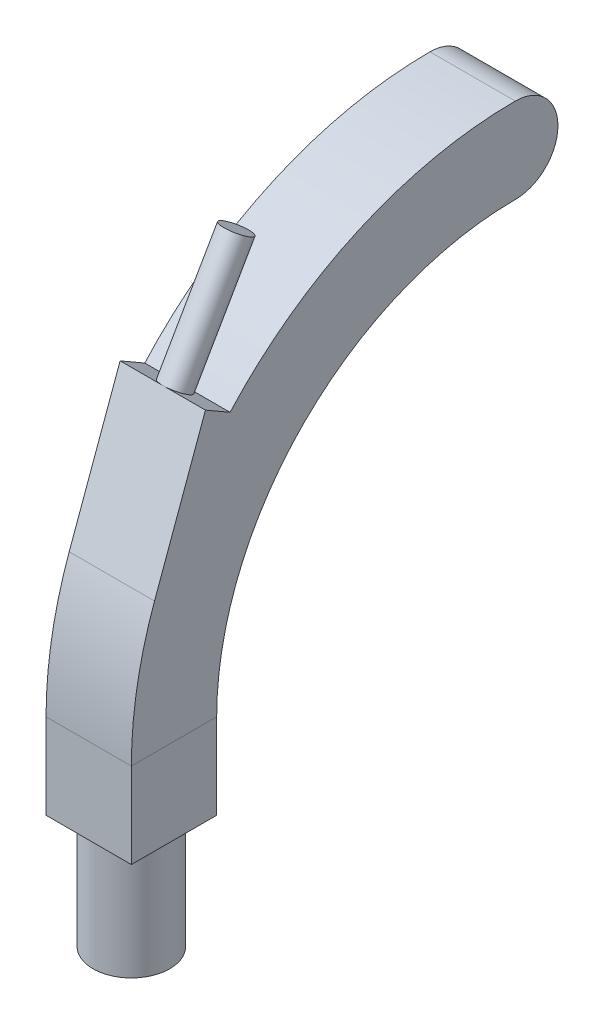
ISO-10303-21;
HEADER;
FILE_DESCRIPTION(('STEP AP214'),'2;1');
FILE_NAME('part.step','',(''),(''),'','','');
FILE_SCHEMA(('AUTOMOTIVE_DESIGN { 1 0 10303 214 1 1 1 1 }'));
ENDSEC;
DATA;
#1=APPLICATION_CONTEXT('core data for automotive mechanical design processes');
#2=APPLICATION_PROTOCOL_DEFINITION('international standard','automotive_design',2000,#1);
#3=PRODUCT_CONTEXT('',#1,'mechanical');
#4=PRODUCT('Part','Part','',(#3));
#5=PRODUCT_RELATED_PRODUCT_CATEGORY('part','',(#4));
#6=PRODUCT_DEFINITION_FORMATION('','',#4);
#7=PRODUCT_DEFINITION_CONTEXT('part definition',#1,'design');
#8=PRODUCT_DEFINITION('design','',#6,#7);
#9=PRODUCT_DEFINITION_SHAPE('','',#8);
#10=(LENGTH_UNIT() NAMED_UNIT(*) SI_UNIT(.MILLI.,.METRE.));
#11=(NAMED_UNIT(*) PLANE_ANGLE_UNIT() SI_UNIT($,.RADIAN.));
#12=(NAMED_UNIT(*) SI_UNIT($,.STERADIAN.) SOLID_ANGLE_UNIT());
#13=UNCERTAINTY_MEASURE_WITH_UNIT(LENGTH_MEASURE(1.E-05),#10,'distance_accuracy_value','');
#14=(GEOMETRIC_REPRESENTATION_CONTEXT(3) GLOBAL_UNCERTAINTY_ASSIGNED_CONTEXT((#13)) GLOBAL_UNIT_ASSIGNED_CONTEXT((#10,
#11,#12)) REPRESENTATION_CONTEXT('',''));
#15=CARTESIAN_POINT('',(0.,0.,0.));
#16=DIRECTION('',(0.,0.,1.));
#17=DIRECTION('',(1.,0.,0.));
#18=AXIS2_PLACEMENT_3D('',#15,#16,#17);
#19=CARTESIAN_POINT('',(70.9100608561074,120.368116529032,-19.7074104681943));
#20=DIRECTION('',(0.,-0.866025403784438,0.500000000000002));
#21=DIRECTION('',(0.,-0.500000000000002,-0.866025403784438));
#22=AXIS2_PLACEMENT_3D('',#19,#20,#21);
#23=PLANE('',#22);
#24=CARTESIAN_POINT('',(0.,122.868116529032,-15.3772834492721));
#25=DIRECTION('',(0.,0.866025403784438,-0.500000000000002));
#26=DIRECTION('',(0.,0.500000000000002,0.866025403784438));
#27=AXIS2_PLACEMENT_3D('',#24,#25,#26);
#28=CIRCLE('',#27,4.99999999999999);
#29=CARTESIAN_POINT('',(0.,120.368116529032,-19.7074104681943));
#30=VERTEX_POINT('',#29);
#31=CARTESIAN_POINT('',(0.,125.368116529032,-11.0471564303499));
#32=VERTEX_POINT('',#31);
#33=EDGE_CURVE('E127',#30,#32,#28,.T.);
#34=ORIENTED_EDGE('',*,*,#33,.F.);
#35=DIRECTION('',(-1.,0.,0.));
#36=VECTOR('',#35,1.);
#37=CARTESIAN_POINT('',(70.9100608561074,120.368116529032,-19.7074104681943));
#38=LINE('',#37,#36);
#39=CARTESIAN_POINT('',(-15.,120.368116529032,-19.7074104681943));
#40=VERTEX_POINT('',#39);
#41=EDGE_CURVE('E59',#30,#40,#38,.T.);
#42=ORIENTED_EDGE('',*,*,#41,.T.);
#43=DIRECTION('',(0.,0.500000000000002,0.866025403784438));
#44=VECTOR('',#43,1.);
#45=CARTESIAN_POINT('',(-15.,120.368116529032,-19.7074104681943));
#46=LINE('',#45,#44);
#47=CARTESIAN_POINT('',(-15.,125.368116529032,-11.0471564303499));
#48=VERTEX_POINT('',#47);
#49=EDGE_CURVE('E134',#40,#48,#46,.T.);
#50=ORIENTED_EDGE('',*,*,#49,.T.);
#51=DIRECTION('',(-1.,0.,0.));
#52=VECTOR('',#51,1.);
#53=CARTESIAN_POINT('',(70.9100608561074,125.368116529032,-11.0471564303499));
#54=LINE('',#53,#52);
#55=EDGE_CURVE('E119',#32,#48,#54,.T.);
#56=ORIENTED_EDGE('',*,*,#55,.F.);
#57=EDGE_LOOP('',(#34,#42,#50,#56));
#58=FACE_BOUND('',#57,.T.);
#59=ADVANCED_FACE('F35',(#58),#23,.F.);
#60=CARTESIAN_POINT('',(0.,30.,-120.));
#61=DIRECTION('',(-1.,0.,0.));
#62=DIRECTION('',(0.,0.,1.));
#63=AXIS2_PLACEMENT_3D('',#60,#61,#62);
#64=CYLINDRICAL_SURFACE('',#63,135.);
#65=CARTESIAN_POINT('',(-15.,30.,-120.));
#66=DIRECTION('',(-1.,0.,0.));
#67=DIRECTION('',(0.,0.,1.));
#68=AXIS2_PLACEMENT_3D('',#65,#66,#67);
#69=CIRCLE('',#68,135.);
#70=CARTESIAN_POINT('',(-15.,165.,-120.));
#71=VERTEX_POINT('',#70);
#72=EDGE_CURVE('E124',#40,#71,#69,.T.);
#73=ORIENTED_EDGE('',*,*,#72,.F.);
#74=ORIENTED_EDGE('',*,*,#41,.F.);
#75=CARTESIAN_POINT('',(15.,120.368116529032,-19.7074104681943));
#76=VERTEX_POINT('',#75);
#77=EDGE_CURVE('E113',#76,#30,#38,.T.);
#78=ORIENTED_EDGE('',*,*,#77,.F.);
#79=CARTESIAN_POINT('',(15.,30.,-120.));
#80=DIRECTION('',(-1.,0.,0.));
#81=DIRECTION('',(0.,0.,1.));
#82=AXIS2_PLACEMENT_3D('',#79,#80,#81);
#83=CIRCLE('',#82,135.);
#84=CARTESIAN_POINT('',(15.,165.,-120.));
#85=VERTEX_POINT('',#84);
#86=EDGE_CURVE('E179',#76,#85,#83,.T.);
#87=ORIENTED_EDGE('',*,*,#86,.T.);
#88=DIRECTION('',(1.,0.,0.));
#89=VECTOR('',#88,1.);
#90=CARTESIAN_POINT('',(-15.,165.,-120.));
#91=LINE('',#90,#89);
#92=EDGE_CURVE('E39',#71,#85,#91,.T.);
#93=ORIENTED_EDGE('',*,*,#92,.F.);
#94=EDGE_LOOP('',(#73,#74,#78,#87,#93));
#95=FACE_BOUND('',#94,.T.);
#96=ADVANCED_FACE('F122',(#95),#64,.T.);
#97=CARTESIAN_POINT('',(0.,0.,0.));
#98=DIRECTION('',(0.,-1.,0.));
#99=DIRECTION('',(0.,0.,-1.));
#100=AXIS2_PLACEMENT_3D('',#97,#98,#99);
#101=PLANE('',#100);
#102=CARTESIAN_POINT('',(0.,0.,0.));
#103=DIRECTION('',(0.,-1.,0.));
#104=DIRECTION('',(0.,0.,-1.));
#105=AXIS2_PLACEMENT_3D('',#102,#103,#104);
#106=CIRCLE('',#105,13.5);
#107=CARTESIAN_POINT('',(0.,0.,-13.5));
#108=VERTEX_POINT('',#107);
#109=EDGE_CURVE('E11',#108,#108,#106,.T.);
#110=ORIENTED_EDGE('',*,*,#109,.F.);
#111=EDGE_LOOP('',(#110));
#112=FACE_BOUND('',#111,.T.);
#113=DIRECTION('',(0.,0.,-1.));
#114=VECTOR('',#113,1.);
#115=CARTESIAN_POINT('',(15.,0.,15.));
#116=LINE('',#115,#114);
#117=CARTESIAN_POINT('',(15.,0.,15.));
#118=VERTEX_POINT('',#117);
#119=CARTESIAN_POINT('',(15.,0.,-15.));
#120=VERTEX_POINT('',#119);
#121=EDGE_CURVE('E156',#118,#120,#116,.T.);
#122=ORIENTED_EDGE('',*,*,#121,.F.);
#123=DIRECTION('',(1.,0.,0.));
#124=VECTOR('',#123,1.);
#125=CARTESIAN_POINT('',(-15.,0.,15.));
#126=LINE('',#125,#124);
#127=CARTESIAN_POINT('',(-15.,0.,15.));
#128=VERTEX_POINT('',#127);
#129=EDGE_CURVE('E171',#128,#118,#126,.T.);
#130=ORIENTED_EDGE('',*,*,#129,.F.);
#131=DIRECTION('',(0.,0.,1.));
#132=VECTOR('',#131,1.);
#133=CARTESIAN_POINT('',(-15.,0.,15.));
#134=LINE('',#133,#132);
#135=CARTESIAN_POINT('',(-15.,0.,-15.));
#136=VERTEX_POINT('',#135);
#137=EDGE_CURVE('E182',#136,#128,#134,.T.);
#138=ORIENTED_EDGE('',*,*,#137,.F.);
#139=DIRECTION('',(-1.,0.,0.));
#140=VECTOR('',#139,1.);
#141=CARTESIAN_POINT('',(-15.,0.,-15.));
#142=LINE('',#141,#140);
#143=EDGE_CURVE('E160',#120,#136,#142,.T.);
#144=ORIENTED_EDGE('',*,*,#143,.F.);
#145=EDGE_LOOP('',(#122,#130,#138,#144));
#146=FACE_BOUND('',#145,.T.);
#147=ADVANCED_FACE('F37',(#112,#146),#101,.T.);
#148=CARTESIAN_POINT('',(15.,0.,15.));
#149=DIRECTION('',(1.,0.,0.));
#150=DIRECTION('',(0.,0.,-1.));
#151=AXIS2_PLACEMENT_3D('',#148,#149,#150);
#152=PLANE('',#151);
#153=DIRECTION('',(0.,1.,0.));
#154=VECTOR('',#153,1.);
#155=CARTESIAN_POINT('',(15.,0.,-15.));
#156=LINE('',#155,#154);
#157=CARTESIAN_POINT('',(15.,30.,-15.));
#158=VERTEX_POINT('',#157);
#159=EDGE_CURVE('E164',#120,#158,#156,.T.);
#160=ORIENTED_EDGE('',*,*,#159,.T.);
#161=DIRECTION('',(0.,0.,-1.));
#162=VECTOR('',#161,1.);
#163=CARTESIAN_POINT('',(15.,30.,15.));
#164=LINE('',#163,#162);
#165=CARTESIAN_POINT('',(15.,30.,15.));
#166=VERTEX_POINT('',#165);
#167=EDGE_CURVE('E161',#166,#158,#164,.T.);
#168=ORIENTED_EDGE('',*,*,#167,.F.);
#169=DIRECTION('',(0.,1.,0.));
#170=VECTOR('',#169,1.);
#171=CARTESIAN_POINT('',(15.,0.,15.));
#172=LINE('',#171,#170);
#173=EDGE_CURVE('E165',#118,#166,#172,.T.);
#174=ORIENTED_EDGE('',*,*,#173,.F.);
#175=ORIENTED_EDGE('',*,*,#121,.T.);
#176=EDGE_LOOP('',(#160,#168,#174,#175));
#177=FACE_BOUND('',#176,.T.);
#178=ADVANCED_FACE('F224',(#177),#152,.T.);
#179=CARTESIAN_POINT('',(-15.,0.,-15.));
#180=DIRECTION('',(0.,0.,-1.));
#181=DIRECTION('',(-1.,0.,0.));
#182=AXIS2_PLACEMENT_3D('',#179,#180,#181);
#183=PLANE('',#182);
#184=DIRECTION('',(0.,1.,0.));
#185=VECTOR('',#184,1.);
#186=CARTESIAN_POINT('',(-15.,0.,-15.));
#187=LINE('',#186,#185);
#188=CARTESIAN_POINT('',(-15.,30.,-15.));
#189=VERTEX_POINT('',#188);
#190=EDGE_CURVE('E185',#136,#189,#187,.T.);
#191=ORIENTED_EDGE('',*,*,#190,.T.);
#192=DIRECTION('',(-1.,0.,0.));
#193=VECTOR('',#192,1.);
#194=CARTESIAN_POINT('',(-15.,30.,-15.));
#195=LINE('',#194,#193);
#196=EDGE_CURVE('E168',#158,#189,#195,.T.);
#197=ORIENTED_EDGE('',*,*,#196,.F.);
#198=ORIENTED_EDGE('',*,*,#159,.F.);
#199=ORIENTED_EDGE('',*,*,#143,.T.);
#200=EDGE_LOOP('',(#191,#197,#198,#199));
#201=FACE_BOUND('',#200,.T.);
#202=ADVANCED_FACE('F221',(#201),#183,.T.);
#203=CARTESIAN_POINT('',(-15.,0.,15.));
#204=DIRECTION('',(-1.,0.,0.));
#205=DIRECTION('',(0.,0.,1.));
#206=AXIS2_PLACEMENT_3D('',#203,#204,#205);
#207=PLANE('',#206);
#208=DIRECTION('',(0.,1.,0.));
#209=VECTOR('',#208,1.);
#210=CARTESIAN_POINT('',(-15.,0.,15.));
#211=LINE('',#210,#209);
#212=CARTESIAN_POINT('',(-15.,30.,15.));
#213=VERTEX_POINT('',#212);
#214=EDGE_CURVE('E197',#128,#213,#211,.T.);
#215=ORIENTED_EDGE('',*,*,#214,.T.);
#216=DIRECTION('',(0.,0.,1.));
#217=VECTOR('',#216,1.);
#218=CARTESIAN_POINT('',(-15.,30.,15.));
#219=LINE('',#218,#217);
#220=EDGE_CURVE('E188',#189,#213,#219,.T.);
#221=ORIENTED_EDGE('',*,*,#220,.F.);
#222=ORIENTED_EDGE('',*,*,#190,.F.);
#223=ORIENTED_EDGE('',*,*,#137,.T.);
#224=EDGE_LOOP('',(#215,#221,#222,#223));
#225=FACE_BOUND('',#224,.T.);
#226=ADVANCED_FACE('F232',(#225),#207,.T.);
#227=CARTESIAN_POINT('',(-15.,0.,15.));
#228=DIRECTION('',(0.,0.,1.));
#229=DIRECTION('',(1.,0.,0.));
#230=AXIS2_PLACEMENT_3D('',#227,#228,#229);
#231=PLANE('',#230);
#232=DIRECTION('',(1.,0.,0.));
#233=VECTOR('',#232,1.);
#234=CARTESIAN_POINT('',(-15.,30.,15.));
#235=LINE('',#234,#233);
#236=EDGE_CURVE('E200',#213,#166,#235,.T.);
#237=ORIENTED_EDGE('',*,*,#236,.F.);
#238=ORIENTED_EDGE('',*,*,#214,.F.);
#239=ORIENTED_EDGE('',*,*,#129,.T.);
#240=ORIENTED_EDGE('',*,*,#173,.T.);
#241=EDGE_LOOP('',(#237,#238,#239,#240));
#242=FACE_BOUND('',#241,.T.);
#243=ADVANCED_FACE('F229',(#242),#231,.T.);
#244=CARTESIAN_POINT('',(15.,30.,15.));
#245=DIRECTION('',(1.,0.,0.));
#246=DIRECTION('',(0.,0.,-1.));
#247=AXIS2_PLACEMENT_3D('',#244,#245,#246);
#248=PLANE('',#247);
#249=CARTESIAN_POINT('',(15.,30.,-120.));
#250=DIRECTION('',(-1.,0.,0.));
#251=DIRECTION('',(0.,0.,1.));
#252=AXIS2_PLACEMENT_3D('',#249,#250,#251);
#253=CIRCLE('',#252,105.);
#254=CARTESIAN_POINT('',(15.,135.,-120.));
#255=VERTEX_POINT('',#254);
#256=EDGE_CURVE('E172',#158,#255,#253,.T.);
#257=ORIENTED_EDGE('',*,*,#256,.T.);
#258=CARTESIAN_POINT('',(15.,150.,-120.));
#259=DIRECTION('',(1.,0.,0.));
#260=DIRECTION('',(0.,0.,-1.));
#261=AXIS2_PLACEMENT_3D('',#258,#259,#260);
#262=CIRCLE('',#261,15.);
#263=EDGE_CURVE('E141',#255,#85,#262,.T.);
#264=ORIENTED_EDGE('',*,*,#263,.T.);
#265=ORIENTED_EDGE('',*,*,#86,.F.);
#266=DIRECTION('',(0.,0.500000000000002,0.866025403784438));
#267=VECTOR('',#266,1.);
#268=CARTESIAN_POINT('',(15.,120.368116529032,-19.7074104681943));
#269=LINE('',#268,#267);
#270=CARTESIAN_POINT('',(15.,125.368116529032,-11.0471564303499));
#271=VERTEX_POINT('',#270);
#272=EDGE_CURVE('E116',#76,#271,#269,.T.);
#273=ORIENTED_EDGE('',*,*,#272,.T.);
#274=DIRECTION('',(0.,-0.93969262078591,0.342020143325665));
#275=VECTOR('',#274,1.);
#276=CARTESIAN_POINT('',(15.,125.368116529032,-11.0471564303499));
#277=LINE('',#276,#275);
#278=CARTESIAN_POINT('',(15.,76.1727193489647,6.85850380609787));
#279=VERTEX_POINT('',#278);
#280=EDGE_CURVE('E142',#271,#279,#277,.T.);
#281=ORIENTED_EDGE('',*,*,#280,.T.);
#282=EDGE_CURVE('E176',#166,#279,#83,.T.);
#283=ORIENTED_EDGE('',*,*,#282,.F.);
#284=ORIENTED_EDGE('',*,*,#167,.T.);
#285=EDGE_LOOP('',(#257,#264,#265,#273,#281,#283,#284));
#286=FACE_BOUND('',#285,.T.);
#287=ADVANCED_FACE('F215',(#286),#248,.T.);
#288=CARTESIAN_POINT('',(0.,30.,-120.));
#289=DIRECTION('',(-1.,0.,0.));
#290=DIRECTION('',(0.,0.,1.));
#291=AXIS2_PLACEMENT_3D('',#288,#289,#290);
#292=CYLINDRICAL_SURFACE('',#291,105.);
#293=CARTESIAN_POINT('',(-15.,30.,-120.));
#294=DIRECTION('',(-1.,0.,0.));
#295=DIRECTION('',(0.,0.,1.));
#296=AXIS2_PLACEMENT_3D('',#293,#294,#295);
#297=CIRCLE('',#296,105.);
#298=CARTESIAN_POINT('',(-15.,135.,-120.));
#299=VERTEX_POINT('',#298);
#300=EDGE_CURVE('E191',#189,#299,#297,.T.);
#301=ORIENTED_EDGE('',*,*,#300,.T.);
#302=DIRECTION('',(-1.,0.,0.));
#303=VECTOR('',#302,1.);
#304=CARTESIAN_POINT('',(-15.,135.,-120.));
#305=LINE('',#304,#303);
#306=EDGE_CURVE('E175',#255,#299,#305,.T.);
#307=ORIENTED_EDGE('',*,*,#306,.F.);
#308=ORIENTED_EDGE('',*,*,#256,.F.);
#309=ORIENTED_EDGE('',*,*,#196,.T.);
#310=EDGE_LOOP('',(#301,#307,#308,#309));
#311=FACE_BOUND('',#310,.T.);
#312=ADVANCED_FACE('F218',(#311),#292,.F.);
#313=CARTESIAN_POINT('',(-15.,30.,15.));
#314=DIRECTION('',(-1.,0.,0.));
#315=DIRECTION('',(0.,0.,1.));
#316=AXIS2_PLACEMENT_3D('',#313,#314,#315);
#317=PLANE('',#316);
#318=CARTESIAN_POINT('',(-15.,76.1727193489647,6.85850380609787));
#319=VERTEX_POINT('',#318);
#320=EDGE_CURVE('E201',#213,#319,#69,.T.);
#321=ORIENTED_EDGE('',*,*,#320,.T.);
#322=DIRECTION('',(0.,-0.93969262078591,0.342020143325665));
#323=VECTOR('',#322,1.);
#324=CARTESIAN_POINT('',(-15.,125.368116529032,-11.0471564303499));
#325=LINE('',#324,#323);
#326=EDGE_CURVE('E138',#48,#319,#325,.T.);
#327=ORIENTED_EDGE('',*,*,#326,.F.);
#328=ORIENTED_EDGE('',*,*,#49,.F.);
#329=ORIENTED_EDGE('',*,*,#72,.T.);
#330=CARTESIAN_POINT('',(-15.,150.,-120.));
#331=DIRECTION('',(-1.,0.,0.));
#332=DIRECTION('',(0.,0.,1.));
#333=AXIS2_PLACEMENT_3D('',#330,#331,#332);
#334=CIRCLE('',#333,15.);
#335=EDGE_CURVE('E151',#299,#71,#334,.F.);
#336=ORIENTED_EDGE('',*,*,#335,.F.);
#337=ORIENTED_EDGE('',*,*,#300,.F.);
#338=ORIENTED_EDGE('',*,*,#220,.T.);
#339=EDGE_LOOP('',(#321,#327,#328,#329,#336,#337,#338));
#340=FACE_BOUND('',#339,.T.);
#341=ADVANCED_FACE('F234',(#340),#317,.T.);
#342=DIRECTION('',(-1.,0.,0.));
#343=VECTOR('',#342,1.);
#344=CARTESIAN_POINT('',(70.9100608561074,76.1727193489647,6.85850380609787));
#345=LINE('',#344,#343);
#346=EDGE_CURVE('E125',#279,#319,#345,.T.);
#347=ORIENTED_EDGE('',*,*,#346,.T.);
#348=ORIENTED_EDGE('',*,*,#320,.F.);
#349=ORIENTED_EDGE('',*,*,#236,.T.);
#350=ORIENTED_EDGE('',*,*,#282,.T.);
#351=EDGE_LOOP('',(#347,#348,#349,#350));
#352=FACE_BOUND('',#351,.T.);
#353=ADVANCED_FACE('F239',(#352),#64,.T.);
#354=CARTESIAN_POINT('',(0.,-40.,0.));
#355=DIRECTION('',(0.,1.,0.));
#356=DIRECTION('',(0.,0.,1.));
#357=AXIS2_PLACEMENT_3D('',#354,#355,#356);
#358=CYLINDRICAL_SURFACE('',#357,13.5);
#359=CARTESIAN_POINT('',(0.,-40.,0.));
#360=DIRECTION('',(0.,-1.,0.));
#361=DIRECTION('',(0.,0.,-1.));
#362=AXIS2_PLACEMENT_3D('',#359,#360,#361);
#363=CIRCLE('',#362,13.5);
#364=CARTESIAN_POINT('',(0.,-40.,-13.5));
#365=VERTEX_POINT('',#364);
#366=EDGE_CURVE('E154',#365,#365,#363,.T.);
#367=ORIENTED_EDGE('',*,*,#366,.F.);
#368=EDGE_LOOP('',(#367));
#369=FACE_BOUND('',#368,.T.);
#370=ORIENTED_EDGE('',*,*,#109,.T.);
#371=EDGE_LOOP('',(#370));
#372=FACE_BOUND('',#371,.T.);
#373=ADVANCED_FACE('F241',(#369,#372),#358,.T.);
#374=CARTESIAN_POINT('',(0.,-40.,0.));
#375=DIRECTION('',(0.,-1.,0.));
#376=DIRECTION('',(0.,0.,-1.));
#377=AXIS2_PLACEMENT_3D('',#374,#375,#376);
#378=PLANE('',#377);
#379=ORIENTED_EDGE('',*,*,#366,.T.);
#380=EDGE_LOOP('',(#379));
#381=FACE_BOUND('',#380,.T.);
#382=ADVANCED_FACE('F247',(#381),#378,.T.);
#383=CARTESIAN_POINT('',(-48.5410196624968,150.,-120.));
#384=DIRECTION('',(1.,0.,0.));
#385=DIRECTION('',(0.,0.,-1.));
#386=AXIS2_PLACEMENT_3D('',#383,#384,#385);
#387=CYLINDRICAL_SURFACE('',#386,15.);
#388=ORIENTED_EDGE('',*,*,#306,.T.);
#389=ORIENTED_EDGE('',*,*,#335,.T.);
#390=ORIENTED_EDGE('',*,*,#92,.T.);
#391=ORIENTED_EDGE('',*,*,#263,.F.);
#392=EDGE_LOOP('',(#388,#389,#390,#391));
#393=FACE_BOUND('',#392,.T.);
#394=ADVANCED_FACE('F213',(#393),#387,.T.);
#395=EDGE_CURVE('E51',#32,#30,#28,.T.);
#396=ORIENTED_EDGE('',*,*,#395,.F.);
#397=EDGE_CURVE('E144',#271,#32,#54,.T.);
#398=ORIENTED_EDGE('',*,*,#397,.F.);
#399=ORIENTED_EDGE('',*,*,#272,.F.);
#400=ORIENTED_EDGE('',*,*,#77,.T.);
#401=EDGE_LOOP('',(#396,#398,#399,#400));
#402=FACE_BOUND('',#401,.T.);
#403=ADVANCED_FACE('F114',(#402),#23,.F.);
#404=CARTESIAN_POINT('',(70.9100608561074,125.368116529032,-11.0471564303499));
#405=DIRECTION('',(0.,-0.342020143325665,-0.93969262078591));
#406=DIRECTION('',(0.,0.93969262078591,-0.342020143325665));
#407=AXIS2_PLACEMENT_3D('',#404,#405,#406);
#408=PLANE('',#407);
#409=ORIENTED_EDGE('',*,*,#280,.F.);
#410=ORIENTED_EDGE('',*,*,#397,.T.);
#411=ORIENTED_EDGE('',*,*,#55,.T.);
#412=ORIENTED_EDGE('',*,*,#326,.T.);
#413=ORIENTED_EDGE('',*,*,#346,.F.);
#414=EDGE_LOOP('',(#409,#410,#411,#412,#413));
#415=FACE_BOUND('',#414,.T.);
#416=ADVANCED_FACE('F238',(#415),#408,.F.);
#417=CARTESIAN_POINT('',(0.,172.393554827184,-43.9708085824443));
#418=DIRECTION('',(0.,-0.866025403784438,0.500000000000002));
#419=DIRECTION('',(0.,-0.500000000000002,-0.866025403784438));
#420=AXIS2_PLACEMENT_3D('',#417,#418,#419);
#421=CYLINDRICAL_SURFACE('',#420,4.99999999999999);
#422=CARTESIAN_POINT('',(0.,160.146106113268,-36.8997407705789));
#423=DIRECTION('',(0.,-0.866025403784437,0.500000000000004));
#424=DIRECTION('',(0.,-0.500000000000004,-0.866025403784437));
#425=AXIS2_PLACEMENT_3D('',#422,#423,#424);
#426=CIRCLE('',#425,4.99999999999999);
#427=CARTESIAN_POINT('',(0.,157.646106113268,-41.229867789501));
#428=VERTEX_POINT('',#427);
#429=EDGE_CURVE('E132',#428,#428,#426,.T.);
#430=ORIENTED_EDGE('',*,*,#429,.T.);
#431=EDGE_LOOP('',(#430));
#432=FACE_BOUND('',#431,.T.);
#433=ORIENTED_EDGE('',*,*,#395,.T.);
#434=ORIENTED_EDGE('',*,*,#33,.T.);
#435=EDGE_LOOP('',(#433,#434));
#436=FACE_BOUND('',#435,.T.);
#437=ADVANCED_FACE('F131',(#432,#436),#421,.T.);
#438=CARTESIAN_POINT('',(-25.,165.146106113268,-28.2394867327346));
#439=DIRECTION('',(0.,-0.866025403784437,0.500000000000004));
#440=DIRECTION('',(0.,-0.500000000000004,-0.866025403784437));
#441=AXIS2_PLACEMENT_3D('',#438,#439,#440);
#442=PLANE('',#441);
#443=ORIENTED_EDGE('',*,*,#429,.F.);
#444=EDGE_LOOP('',(#443));
#445=FACE_BOUND('',#444,.T.);
#446=ADVANCED_FACE('F355',(#445),#442,.F.);
#447=CLOSED_SHELL('',(#59,#96,#147,#178,#202,#226,#243,#287,#312,#341,#353,#373,#382,#394,#403,
#416,#437,#446));
#448=MANIFOLD_SOLID_BREP('B2',#447);
#449=ADVANCED_BREP_SHAPE_REPRESENTATION('',(#18,#448),#14);
#450=SHAPE_DEFINITION_REPRESENTATION(#9,#449);
ENDSEC;
END-ISO-10303-21;
